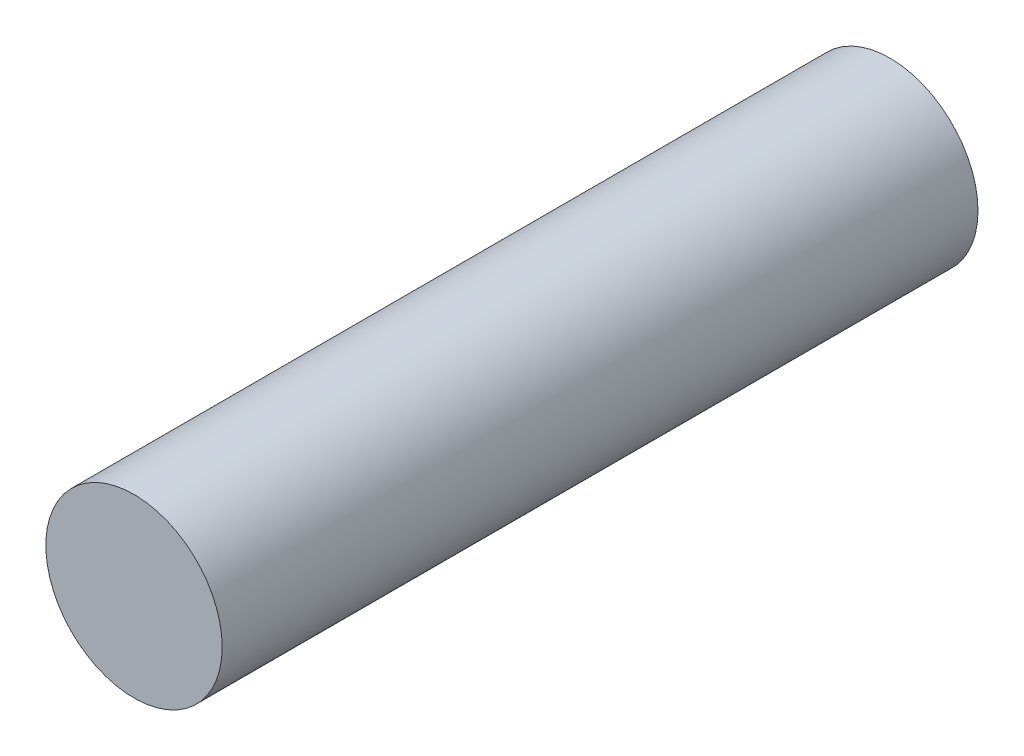
ISO-10303-21;
HEADER;
FILE_DESCRIPTION(('STEP AP214'),'2;1');
FILE_NAME('part.step','',(''),(''),'','','');
FILE_SCHEMA(('AUTOMOTIVE_DESIGN { 1 0 10303 214 1 1 1 1 }'));
ENDSEC;
DATA;
#1=APPLICATION_CONTEXT('core data for automotive mechanical design processes');
#2=APPLICATION_PROTOCOL_DEFINITION('international standard','automotive_design',2000,#1);
#3=PRODUCT_CONTEXT('',#1,'mechanical');
#4=PRODUCT('Part','Part','',(#3));
#5=PRODUCT_RELATED_PRODUCT_CATEGORY('part','',(#4));
#6=PRODUCT_DEFINITION_FORMATION('','',#4);
#7=PRODUCT_DEFINITION_CONTEXT('part definition',#1,'design');
#8=PRODUCT_DEFINITION('design','',#6,#7);
#9=PRODUCT_DEFINITION_SHAPE('','',#8);
#10=(LENGTH_UNIT() NAMED_UNIT(*) SI_UNIT(.MILLI.,.METRE.));
#11=(NAMED_UNIT(*) PLANE_ANGLE_UNIT() SI_UNIT($,.RADIAN.));
#12=(NAMED_UNIT(*) SI_UNIT($,.STERADIAN.) SOLID_ANGLE_UNIT());
#13=UNCERTAINTY_MEASURE_WITH_UNIT(LENGTH_MEASURE(1.E-05),#10,'distance_accuracy_value','');
#14=(GEOMETRIC_REPRESENTATION_CONTEXT(3) GLOBAL_UNCERTAINTY_ASSIGNED_CONTEXT((#13)) GLOBAL_UNIT_ASSIGNED_CONTEXT((#10,
#11,#12)) REPRESENTATION_CONTEXT('',''));
#15=CARTESIAN_POINT('',(0.,0.,0.));
#16=DIRECTION('',(0.,0.,1.));
#17=DIRECTION('',(1.,0.,0.));
#18=AXIS2_PLACEMENT_3D('',#15,#16,#17);
#19=CARTESIAN_POINT('',(0.,0.,18.));
#20=DIRECTION('',(0.,0.,-1.));
#21=DIRECTION('',(-1.,0.,0.));
#22=AXIS2_PLACEMENT_3D('',#19,#20,#21);
#23=CYLINDRICAL_SURFACE('',#22,2.1);
#24=CARTESIAN_POINT('',(0.,0.,18.));
#25=DIRECTION('',(0.,0.,1.));
#26=DIRECTION('',(1.,0.,0.));
#27=AXIS2_PLACEMENT_3D('',#24,#25,#26);
#28=CIRCLE('',#27,2.1);
#29=CARTESIAN_POINT('',(2.1,0.,18.));
#30=VERTEX_POINT('',#29);
#31=EDGE_CURVE('E10',#30,#30,#28,.T.);
#32=ORIENTED_EDGE('',*,*,#31,.F.);
#33=EDGE_LOOP('',(#32));
#34=FACE_BOUND('',#33,.T.);
#35=CARTESIAN_POINT('',(0.,0.,0.));
#36=DIRECTION('',(0.,0.,1.));
#37=DIRECTION('',(1.,0.,0.));
#38=AXIS2_PLACEMENT_3D('',#35,#36,#37);
#39=CIRCLE('',#38,2.1);
#40=CARTESIAN_POINT('',(2.1,0.,0.));
#41=VERTEX_POINT('',#40);
#42=EDGE_CURVE('E40',#41,#41,#39,.T.);
#43=ORIENTED_EDGE('',*,*,#42,.T.);
#44=EDGE_LOOP('',(#43));
#45=FACE_BOUND('',#44,.T.);
#46=ADVANCED_FACE('F37',(#34,#45),#23,.T.);
#47=CARTESIAN_POINT('',(0.,0.,18.));
#48=DIRECTION('',(0.,0.,1.));
#49=DIRECTION('',(1.,0.,0.));
#50=AXIS2_PLACEMENT_3D('',#47,#48,#49);
#51=PLANE('',#50);
#52=ORIENTED_EDGE('',*,*,#31,.T.);
#53=EDGE_LOOP('',(#52));
#54=FACE_BOUND('',#53,.T.);
#55=ADVANCED_FACE('F54',(#54),#51,.T.);
#56=CARTESIAN_POINT('',(0.,0.,0.));
#57=DIRECTION('',(0.,0.,1.));
#58=DIRECTION('',(1.,0.,0.));
#59=AXIS2_PLACEMENT_3D('',#56,#57,#58);
#60=PLANE('',#59);
#61=ORIENTED_EDGE('',*,*,#42,.F.);
#62=EDGE_LOOP('',(#61));
#63=FACE_BOUND('',#62,.T.);
#64=ADVANCED_FACE('F52',(#63),#60,.F.);
#65=CLOSED_SHELL('',(#46,#55,#64));
#66=MANIFOLD_SOLID_BREP('B2',#65);
#67=ADVANCED_BREP_SHAPE_REPRESENTATION('',(#18,#66),#14);
#68=SHAPE_DEFINITION_REPRESENTATION(#9,#67);
ENDSEC;
END-ISO-10303-21;
